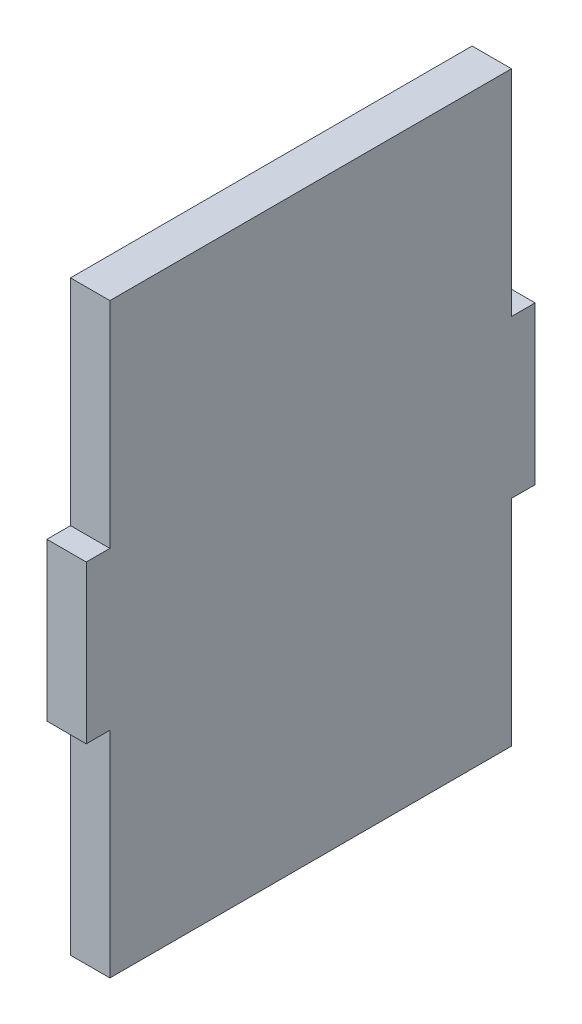
ISO-10303-21;
HEADER;
FILE_DESCRIPTION(('STEP AP214'),'2;1');
FILE_NAME('part.step','',(''),(''),'','','');
FILE_SCHEMA(('AUTOMOTIVE_DESIGN { 1 0 10303 214 1 1 1 1 }'));
ENDSEC;
DATA;
#1=APPLICATION_CONTEXT('core data for automotive mechanical design processes');
#2=APPLICATION_PROTOCOL_DEFINITION('international standard','automotive_design',2000,#1);
#3=PRODUCT_CONTEXT('',#1,'mechanical');
#4=PRODUCT('Part','Part','',(#3));
#5=PRODUCT_RELATED_PRODUCT_CATEGORY('part','',(#4));
#6=PRODUCT_DEFINITION_FORMATION('','',#4);
#7=PRODUCT_DEFINITION_CONTEXT('part definition',#1,'design');
#8=PRODUCT_DEFINITION('design','',#6,#7);
#9=PRODUCT_DEFINITION_SHAPE('','',#8);
#10=(LENGTH_UNIT() NAMED_UNIT(*) SI_UNIT(.MILLI.,.METRE.));
#11=(NAMED_UNIT(*) PLANE_ANGLE_UNIT() SI_UNIT($,.RADIAN.));
#12=(NAMED_UNIT(*) SI_UNIT($,.STERADIAN.) SOLID_ANGLE_UNIT());
#13=UNCERTAINTY_MEASURE_WITH_UNIT(LENGTH_MEASURE(1.E-05),#10,'distance_accuracy_value','');
#14=(GEOMETRIC_REPRESENTATION_CONTEXT(3) GLOBAL_UNCERTAINTY_ASSIGNED_CONTEXT((#13)) GLOBAL_UNIT_ASSIGNED_CONTEXT((#10,
#11,#12)) REPRESENTATION_CONTEXT('',''));
#15=CARTESIAN_POINT('',(0.,0.,0.));
#16=DIRECTION('',(0.,0.,1.));
#17=DIRECTION('',(1.,0.,0.));
#18=AXIS2_PLACEMENT_3D('',#15,#16,#17);
#19=CARTESIAN_POINT('',(0.,0.,5.));
#20=DIRECTION('',(0.,0.,1.));
#21=DIRECTION('',(1.,0.,0.));
#22=AXIS2_PLACEMENT_3D('',#19,#20,#21);
#23=PLANE('',#22);
#24=DIRECTION('',(0.,-1.,0.));
#25=VECTOR('',#24,1.);
#26=CARTESIAN_POINT('',(0.,0.,5.));
#27=LINE('',#26,#25);
#28=CARTESIAN_POINT('',(0.,-46.7498009701519,5.));
#29=VERTEX_POINT('',#28);
#30=CARTESIAN_POINT('',(0.,-73.9996019403038,5.));
#31=VERTEX_POINT('',#30);
#32=EDGE_CURVE('E207',#29,#31,#27,.T.);
#33=ORIENTED_EDGE('',*,*,#32,.F.);
#34=DIRECTION('',(1.,0.,0.));
#35=VECTOR('',#34,1.);
#36=CARTESIAN_POINT('',(0.,-46.7498009701519,5.));
#37=LINE('',#36,#35);
#38=CARTESIAN_POINT('',(4.99999999999999,-46.7498009701519,5.));
#39=VERTEX_POINT('',#38);
#40=EDGE_CURVE('E142',#29,#39,#37,.T.);
#41=ORIENTED_EDGE('',*,*,#40,.T.);
#42=DIRECTION('',(0.,1.,0.));
#43=VECTOR('',#42,1.);
#44=CARTESIAN_POINT('',(4.99999999999999,0.,5.));
#45=LINE('',#44,#43);
#46=CARTESIAN_POINT('',(4.99999999999999,-73.9996019403038,5.));
#47=VERTEX_POINT('',#46);
#48=EDGE_CURVE('E201',#47,#39,#45,.T.);
#49=ORIENTED_EDGE('',*,*,#48,.F.);
#50=DIRECTION('',(1.,0.,0.));
#51=VECTOR('',#50,1.);
#52=CARTESIAN_POINT('',(0.,-73.9996019403038,5.));
#53=LINE('',#52,#51);
#54=EDGE_CURVE('E184',#31,#47,#53,.T.);
#55=ORIENTED_EDGE('',*,*,#54,.F.);
#56=EDGE_LOOP('',(#33,#41,#49,#55));
#57=FACE_BOUND('',#56,.T.);
#58=ADVANCED_FACE('F36',(#57),#23,.F.);
#59=CARTESIAN_POINT('',(0.,0.,56.));
#60=DIRECTION('',(0.,0.,1.));
#61=DIRECTION('',(1.,0.,0.));
#62=AXIS2_PLACEMENT_3D('',#59,#60,#61);
#63=PLANE('',#62);
#64=DIRECTION('',(-1.,0.,0.));
#65=VECTOR('',#64,1.);
#66=CARTESIAN_POINT('',(0.,-26.7498009701519,56.));
#67=LINE('',#66,#65);
#68=CARTESIAN_POINT('',(4.99999999999999,-26.7498009701519,56.));
#69=VERTEX_POINT('',#68);
#70=CARTESIAN_POINT('',(0.,-26.7498009701519,56.));
#71=VERTEX_POINT('',#70);
#72=EDGE_CURVE('E163',#69,#71,#67,.T.);
#73=ORIENTED_EDGE('',*,*,#72,.F.);
#74=DIRECTION('',(0.,1.,0.));
#75=VECTOR('',#74,1.);
#76=CARTESIAN_POINT('',(4.99999999999999,0.,56.));
#77=LINE('',#76,#75);
#78=CARTESIAN_POINT('',(4.99999999999999,0.5,56.));
#79=VERTEX_POINT('',#78);
#80=EDGE_CURVE('E188',#69,#79,#77,.T.);
#81=ORIENTED_EDGE('',*,*,#80,.T.);
#82=DIRECTION('',(1.,0.,0.));
#83=VECTOR('',#82,1.);
#84=CARTESIAN_POINT('',(0.,0.5,56.));
#85=LINE('',#84,#83);
#86=CARTESIAN_POINT('',(0.,0.5,56.));
#87=VERTEX_POINT('',#86);
#88=EDGE_CURVE('E191',#87,#79,#85,.T.);
#89=ORIENTED_EDGE('',*,*,#88,.F.);
#90=DIRECTION('',(0.,-1.,0.));
#91=VECTOR('',#90,1.);
#92=CARTESIAN_POINT('',(0.,0.,56.));
#93=LINE('',#92,#91);
#94=EDGE_CURVE('E195',#87,#71,#93,.T.);
#95=ORIENTED_EDGE('',*,*,#94,.T.);
#96=EDGE_LOOP('',(#73,#81,#89,#95));
#97=FACE_BOUND('',#96,.T.);
#98=ADVANCED_FACE('F250',(#97),#63,.T.);
#99=CARTESIAN_POINT('',(0.,-73.9996019403038,56.));
#100=DIRECTION('',(0.,1.,0.));
#101=DIRECTION('',(0.,0.,1.));
#102=AXIS2_PLACEMENT_3D('',#99,#100,#101);
#103=PLANE('',#102);
#104=ORIENTED_EDGE('',*,*,#54,.T.);
#105=DIRECTION('',(0.,0.,-1.));
#106=VECTOR('',#105,1.);
#107=CARTESIAN_POINT('',(4.99999999999999,-73.9996019403038,56.));
#108=LINE('',#107,#106);
#109=CARTESIAN_POINT('',(4.99999999999999,-73.9996019403038,56.));
#110=VERTEX_POINT('',#109);
#111=EDGE_CURVE('E11',#110,#47,#108,.T.);
#112=ORIENTED_EDGE('',*,*,#111,.F.);
#113=DIRECTION('',(1.,0.,0.));
#114=VECTOR('',#113,1.);
#115=CARTESIAN_POINT('',(0.,-73.9996019403038,56.));
#116=LINE('',#115,#114);
#117=CARTESIAN_POINT('',(0.,-73.9996019403038,56.));
#118=VERTEX_POINT('',#117);
#119=EDGE_CURVE('E185',#118,#110,#116,.T.);
#120=ORIENTED_EDGE('',*,*,#119,.F.);
#121=DIRECTION('',(0.,0.,-1.));
#122=VECTOR('',#121,1.);
#123=CARTESIAN_POINT('',(0.,-73.9996019403038,56.));
#124=LINE('',#123,#122);
#125=EDGE_CURVE('E197',#118,#31,#124,.T.);
#126=ORIENTED_EDGE('',*,*,#125,.T.);
#127=EDGE_LOOP('',(#104,#112,#120,#126));
#128=FACE_BOUND('',#127,.T.);
#129=ADVANCED_FACE('F38',(#128),#103,.F.);
#130=CARTESIAN_POINT('',(4.99999999999999,0.,56.));
#131=DIRECTION('',(-1.,0.,0.));
#132=DIRECTION('',(0.,-1.,0.));
#133=AXIS2_PLACEMENT_3D('',#130,#131,#132);
#134=PLANE('',#133);
#135=ORIENTED_EDGE('',*,*,#48,.T.);
#136=DIRECTION('',(0.,0.,1.));
#137=VECTOR('',#136,1.);
#138=CARTESIAN_POINT('',(4.99999999999999,-46.7498009701519,2.));
#139=LINE('',#138,#137);
#140=CARTESIAN_POINT('',(4.99999999999999,-46.7498009701519,2.));
#141=VERTEX_POINT('',#140);
#142=EDGE_CURVE('E156',#141,#39,#139,.T.);
#143=ORIENTED_EDGE('',*,*,#142,.F.);
#144=DIRECTION('',(0.,1.,0.));
#145=VECTOR('',#144,1.);
#146=CARTESIAN_POINT('',(4.99999999999999,-46.7498009701519,2.));
#147=LINE('',#146,#145);
#148=CARTESIAN_POINT('',(4.99999999999999,-26.7498009701519,2.));
#149=VERTEX_POINT('',#148);
#150=EDGE_CURVE('E145',#141,#149,#147,.T.);
#151=ORIENTED_EDGE('',*,*,#150,.T.);
#152=DIRECTION('',(0.,0.,1.));
#153=VECTOR('',#152,1.);
#154=CARTESIAN_POINT('',(4.99999999999999,-26.7498009701519,2.));
#155=LINE('',#154,#153);
#156=CARTESIAN_POINT('',(4.99999999999999,-26.7498009701519,5.));
#157=VERTEX_POINT('',#156);
#158=EDGE_CURVE('E132',#149,#157,#155,.T.);
#159=ORIENTED_EDGE('',*,*,#158,.T.);
#160=CARTESIAN_POINT('',(4.99999999999999,0.5,5.));
#161=VERTEX_POINT('',#160);
#162=EDGE_CURVE('E200',#157,#161,#45,.T.);
#163=ORIENTED_EDGE('',*,*,#162,.T.);
#164=DIRECTION('',(0.,0.,-1.));
#165=VECTOR('',#164,1.);
#166=CARTESIAN_POINT('',(4.99999999999999,0.5,56.));
#167=LINE('',#166,#165);
#168=EDGE_CURVE('E44',#79,#161,#167,.T.);
#169=ORIENTED_EDGE('',*,*,#168,.F.);
#170=ORIENTED_EDGE('',*,*,#80,.F.);
#171=DIRECTION('',(0.,0.,-1.));
#172=VECTOR('',#171,1.);
#173=CARTESIAN_POINT('',(4.99999999999999,-26.7498009701519,59.));
#174=LINE('',#173,#172);
#175=CARTESIAN_POINT('',(4.99999999999999,-26.7498009701519,59.));
#176=VERTEX_POINT('',#175);
#177=EDGE_CURVE('E175',#176,#69,#174,.T.);
#178=ORIENTED_EDGE('',*,*,#177,.F.);
#179=DIRECTION('',(0.,1.,0.));
#180=VECTOR('',#179,1.);
#181=CARTESIAN_POINT('',(4.99999999999999,-46.7498009701519,59.));
#182=LINE('',#181,#180);
#183=CARTESIAN_POINT('',(4.99999999999999,-46.7498009701519,59.));
#184=VERTEX_POINT('',#183);
#185=EDGE_CURVE('E165',#184,#176,#182,.T.);
#186=ORIENTED_EDGE('',*,*,#185,.F.);
#187=DIRECTION('',(0.,0.,-1.));
#188=VECTOR('',#187,1.);
#189=CARTESIAN_POINT('',(4.99999999999999,-46.7498009701519,59.));
#190=LINE('',#189,#188);
#191=CARTESIAN_POINT('',(4.99999999999999,-46.7498009701519,56.));
#192=VERTEX_POINT('',#191);
#193=EDGE_CURVE('E178',#184,#192,#190,.T.);
#194=ORIENTED_EDGE('',*,*,#193,.T.);
#195=EDGE_CURVE('E189',#110,#192,#77,.T.);
#196=ORIENTED_EDGE('',*,*,#195,.F.);
#197=ORIENTED_EDGE('',*,*,#111,.T.);
#198=EDGE_LOOP('',(#135,#143,#151,#159,#163,#169,#170,#178,#186,#194,#196,#197));
#199=FACE_BOUND('',#198,.T.);
#200=ADVANCED_FACE('F223',(#199),#134,.F.);
#201=CARTESIAN_POINT('',(0.,0.5,56.));
#202=DIRECTION('',(0.,1.,0.));
#203=DIRECTION('',(-1.,0.,0.));
#204=AXIS2_PLACEMENT_3D('',#201,#202,#203);
#205=PLANE('',#204);
#206=DIRECTION('',(1.,0.,0.));
#207=VECTOR('',#206,1.);
#208=CARTESIAN_POINT('',(0.,0.5,5.));
#209=LINE('',#208,#207);
#210=CARTESIAN_POINT('',(0.,0.5,5.));
#211=VERTEX_POINT('',#210);
#212=EDGE_CURVE('E204',#211,#161,#209,.T.);
#213=ORIENTED_EDGE('',*,*,#212,.F.);
#214=DIRECTION('',(0.,0.,-1.));
#215=VECTOR('',#214,1.);
#216=CARTESIAN_POINT('',(0.,0.5,56.));
#217=LINE('',#216,#215);
#218=EDGE_CURVE('E211',#87,#211,#217,.T.);
#219=ORIENTED_EDGE('',*,*,#218,.F.);
#220=ORIENTED_EDGE('',*,*,#88,.T.);
#221=ORIENTED_EDGE('',*,*,#168,.T.);
#222=EDGE_LOOP('',(#213,#219,#220,#221));
#223=FACE_BOUND('',#222,.T.);
#224=ADVANCED_FACE('F216',(#223),#205,.T.);
#225=CARTESIAN_POINT('',(0.,0.,56.));
#226=DIRECTION('',(1.,0.,0.));
#227=DIRECTION('',(0.,1.,0.));
#228=AXIS2_PLACEMENT_3D('',#225,#226,#227);
#229=PLANE('',#228);
#230=CARTESIAN_POINT('',(0.,-26.7498009701519,5.));
#231=VERTEX_POINT('',#230);
#232=EDGE_CURVE('E131',#211,#231,#27,.T.);
#233=ORIENTED_EDGE('',*,*,#232,.T.);
#234=DIRECTION('',(0.,0.,1.));
#235=VECTOR('',#234,1.);
#236=CARTESIAN_POINT('',(0.,-26.7498009701519,2.));
#237=LINE('',#236,#235);
#238=CARTESIAN_POINT('',(0.,-26.7498009701519,2.));
#239=VERTEX_POINT('',#238);
#240=EDGE_CURVE('E51',#239,#231,#237,.T.);
#241=ORIENTED_EDGE('',*,*,#240,.F.);
#242=DIRECTION('',(0.,-1.,0.));
#243=VECTOR('',#242,1.);
#244=CARTESIAN_POINT('',(0.,-46.7498009701519,2.));
#245=LINE('',#244,#243);
#246=CARTESIAN_POINT('',(0.,-46.7498009701519,2.));
#247=VERTEX_POINT('',#246);
#248=EDGE_CURVE('E128',#239,#247,#245,.T.);
#249=ORIENTED_EDGE('',*,*,#248,.T.);
#250=DIRECTION('',(0.,0.,1.));
#251=VECTOR('',#250,1.);
#252=CARTESIAN_POINT('',(0.,-46.7498009701519,2.));
#253=LINE('',#252,#251);
#254=EDGE_CURVE('E150',#247,#29,#253,.T.);
#255=ORIENTED_EDGE('',*,*,#254,.T.);
#256=ORIENTED_EDGE('',*,*,#32,.T.);
#257=ORIENTED_EDGE('',*,*,#125,.F.);
#258=CARTESIAN_POINT('',(0.,-46.7498009701519,56.));
#259=VERTEX_POINT('',#258);
#260=EDGE_CURVE('E194',#259,#118,#93,.T.);
#261=ORIENTED_EDGE('',*,*,#260,.F.);
#262=DIRECTION('',(0.,0.,-1.));
#263=VECTOR('',#262,1.);
#264=CARTESIAN_POINT('',(0.,-46.7498009701519,59.));
#265=LINE('',#264,#263);
#266=CARTESIAN_POINT('',(0.,-46.7498009701519,59.));
#267=VERTEX_POINT('',#266);
#268=EDGE_CURVE('E181',#267,#259,#265,.T.);
#269=ORIENTED_EDGE('',*,*,#268,.F.);
#270=DIRECTION('',(0.,-1.,0.));
#271=VECTOR('',#270,1.);
#272=CARTESIAN_POINT('',(0.,-46.7498009701519,59.));
#273=LINE('',#272,#271);
#274=CARTESIAN_POINT('',(0.,-26.7498009701519,59.));
#275=VERTEX_POINT('',#274);
#276=EDGE_CURVE('E159',#275,#267,#273,.T.);
#277=ORIENTED_EDGE('',*,*,#276,.F.);
#278=DIRECTION('',(0.,0.,-1.));
#279=VECTOR('',#278,1.);
#280=CARTESIAN_POINT('',(0.,-26.7498009701519,59.));
#281=LINE('',#280,#279);
#282=EDGE_CURVE('E169',#275,#71,#281,.T.);
#283=ORIENTED_EDGE('',*,*,#282,.T.);
#284=ORIENTED_EDGE('',*,*,#94,.F.);
#285=ORIENTED_EDGE('',*,*,#218,.T.);
#286=EDGE_LOOP('',(#233,#241,#249,#255,#256,#257,#261,#269,#277,#283,#284,#285));
#287=FACE_BOUND('',#286,.T.);
#288=ADVANCED_FACE('F127',(#287),#229,.F.);
#289=DIRECTION('',(1.,0.,0.));
#290=VECTOR('',#289,1.);
#291=CARTESIAN_POINT('',(0.,-46.7498009701519,56.));
#292=LINE('',#291,#290);
#293=EDGE_CURVE('E59',#259,#192,#292,.T.);
#294=ORIENTED_EDGE('',*,*,#293,.F.);
#295=ORIENTED_EDGE('',*,*,#260,.T.);
#296=ORIENTED_EDGE('',*,*,#119,.T.);
#297=ORIENTED_EDGE('',*,*,#195,.T.);
#298=EDGE_LOOP('',(#294,#295,#296,#297));
#299=FACE_BOUND('',#298,.T.);
#300=ADVANCED_FACE('F236',(#299),#63,.T.);
#301=ORIENTED_EDGE('',*,*,#162,.F.);
#302=DIRECTION('',(-1.,0.,0.));
#303=VECTOR('',#302,1.);
#304=CARTESIAN_POINT('',(0.,-26.7498009701519,5.));
#305=LINE('',#304,#303);
#306=EDGE_CURVE('E151',#157,#231,#305,.T.);
#307=ORIENTED_EDGE('',*,*,#306,.T.);
#308=ORIENTED_EDGE('',*,*,#232,.F.);
#309=ORIENTED_EDGE('',*,*,#212,.T.);
#310=EDGE_LOOP('',(#301,#307,#308,#309));
#311=FACE_BOUND('',#310,.T.);
#312=ADVANCED_FACE('F222',(#311),#23,.F.);
#313=CARTESIAN_POINT('',(0.,-46.7498009701519,59.));
#314=DIRECTION('',(0.,1.,0.));
#315=DIRECTION('',(0.,0.,1.));
#316=AXIS2_PLACEMENT_3D('',#313,#314,#315);
#317=PLANE('',#316);
#318=ORIENTED_EDGE('',*,*,#293,.T.);
#319=ORIENTED_EDGE('',*,*,#193,.F.);
#320=DIRECTION('',(1.,0.,0.));
#321=VECTOR('',#320,1.);
#322=CARTESIAN_POINT('',(0.,-46.7498009701519,59.));
#323=LINE('',#322,#321);
#324=EDGE_CURVE('E162',#267,#184,#323,.T.);
#325=ORIENTED_EDGE('',*,*,#324,.F.);
#326=ORIENTED_EDGE('',*,*,#268,.T.);
#327=EDGE_LOOP('',(#318,#319,#325,#326));
#328=FACE_BOUND('',#327,.T.);
#329=ADVANCED_FACE('F240',(#328),#317,.F.);
#330=CARTESIAN_POINT('',(0.,-26.7498009701519,59.));
#331=DIRECTION('',(0.,-1.,0.));
#332=DIRECTION('',(0.,0.,-1.));
#333=AXIS2_PLACEMENT_3D('',#330,#331,#332);
#334=PLANE('',#333);
#335=ORIENTED_EDGE('',*,*,#72,.T.);
#336=ORIENTED_EDGE('',*,*,#282,.F.);
#337=DIRECTION('',(-1.,0.,0.));
#338=VECTOR('',#337,1.);
#339=CARTESIAN_POINT('',(0.,-26.7498009701519,59.));
#340=LINE('',#339,#338);
#341=EDGE_CURVE('E167',#176,#275,#340,.T.);
#342=ORIENTED_EDGE('',*,*,#341,.F.);
#343=ORIENTED_EDGE('',*,*,#177,.T.);
#344=EDGE_LOOP('',(#335,#336,#342,#343));
#345=FACE_BOUND('',#344,.T.);
#346=ADVANCED_FACE('F247',(#345),#334,.F.);
#347=CARTESIAN_POINT('',(0.,0.,59.));
#348=DIRECTION('',(0.,0.,-1.));
#349=DIRECTION('',(-1.,0.,0.));
#350=AXIS2_PLACEMENT_3D('',#347,#348,#349);
#351=PLANE('',#350);
#352=ORIENTED_EDGE('',*,*,#276,.T.);
#353=ORIENTED_EDGE('',*,*,#324,.T.);
#354=ORIENTED_EDGE('',*,*,#185,.T.);
#355=ORIENTED_EDGE('',*,*,#341,.T.);
#356=EDGE_LOOP('',(#352,#353,#354,#355));
#357=FACE_BOUND('',#356,.T.);
#358=ADVANCED_FACE('F242',(#357),#351,.F.);
#359=CARTESIAN_POINT('',(0.,-26.7498009701519,2.));
#360=DIRECTION('',(0.,1.,0.));
#361=DIRECTION('',(0.,0.,1.));
#362=AXIS2_PLACEMENT_3D('',#359,#360,#361);
#363=PLANE('',#362);
#364=ORIENTED_EDGE('',*,*,#306,.F.);
#365=ORIENTED_EDGE('',*,*,#158,.F.);
#366=DIRECTION('',(-1.,0.,0.));
#367=VECTOR('',#366,1.);
#368=CARTESIAN_POINT('',(0.,-26.7498009701519,2.));
#369=LINE('',#368,#367);
#370=EDGE_CURVE('E138',#149,#239,#369,.T.);
#371=ORIENTED_EDGE('',*,*,#370,.T.);
#372=ORIENTED_EDGE('',*,*,#240,.T.);
#373=EDGE_LOOP('',(#364,#365,#371,#372));
#374=FACE_BOUND('',#373,.T.);
#375=ADVANCED_FACE('F144',(#374),#363,.T.);
#376=CARTESIAN_POINT('',(0.,-46.7498009701519,2.));
#377=DIRECTION('',(0.,-1.,0.));
#378=DIRECTION('',(0.,0.,-1.));
#379=AXIS2_PLACEMENT_3D('',#376,#377,#378);
#380=PLANE('',#379);
#381=ORIENTED_EDGE('',*,*,#40,.F.);
#382=ORIENTED_EDGE('',*,*,#254,.F.);
#383=DIRECTION('',(1.,0.,0.));
#384=VECTOR('',#383,1.);
#385=CARTESIAN_POINT('',(0.,-46.7498009701519,2.));
#386=LINE('',#385,#384);
#387=EDGE_CURVE('E141',#247,#141,#386,.T.);
#388=ORIENTED_EDGE('',*,*,#387,.T.);
#389=ORIENTED_EDGE('',*,*,#142,.T.);
#390=EDGE_LOOP('',(#381,#382,#388,#389));
#391=FACE_BOUND('',#390,.T.);
#392=ADVANCED_FACE('F226',(#391),#380,.T.);
#393=CARTESIAN_POINT('',(0.,0.,2.));
#394=DIRECTION('',(0.,0.,1.));
#395=DIRECTION('',(-1.,0.,0.));
#396=AXIS2_PLACEMENT_3D('',#393,#394,#395);
#397=PLANE('',#396);
#398=ORIENTED_EDGE('',*,*,#248,.F.);
#399=ORIENTED_EDGE('',*,*,#370,.F.);
#400=ORIENTED_EDGE('',*,*,#150,.F.);
#401=ORIENTED_EDGE('',*,*,#387,.F.);
#402=EDGE_LOOP('',(#398,#399,#400,#401));
#403=FACE_BOUND('',#402,.T.);
#404=ADVANCED_FACE('F136',(#403),#397,.F.);
#405=CLOSED_SHELL('',(#58,#98,#129,#200,#224,#288,#300,#312,#329,#346,#358,#375,#392,#404));
#406=MANIFOLD_SOLID_BREP('B2',#405);
#407=ADVANCED_BREP_SHAPE_REPRESENTATION('',(#18,#406),#14);
#408=SHAPE_DEFINITION_REPRESENTATION(#9,#407);
ENDSEC;
END-ISO-10303-21;
